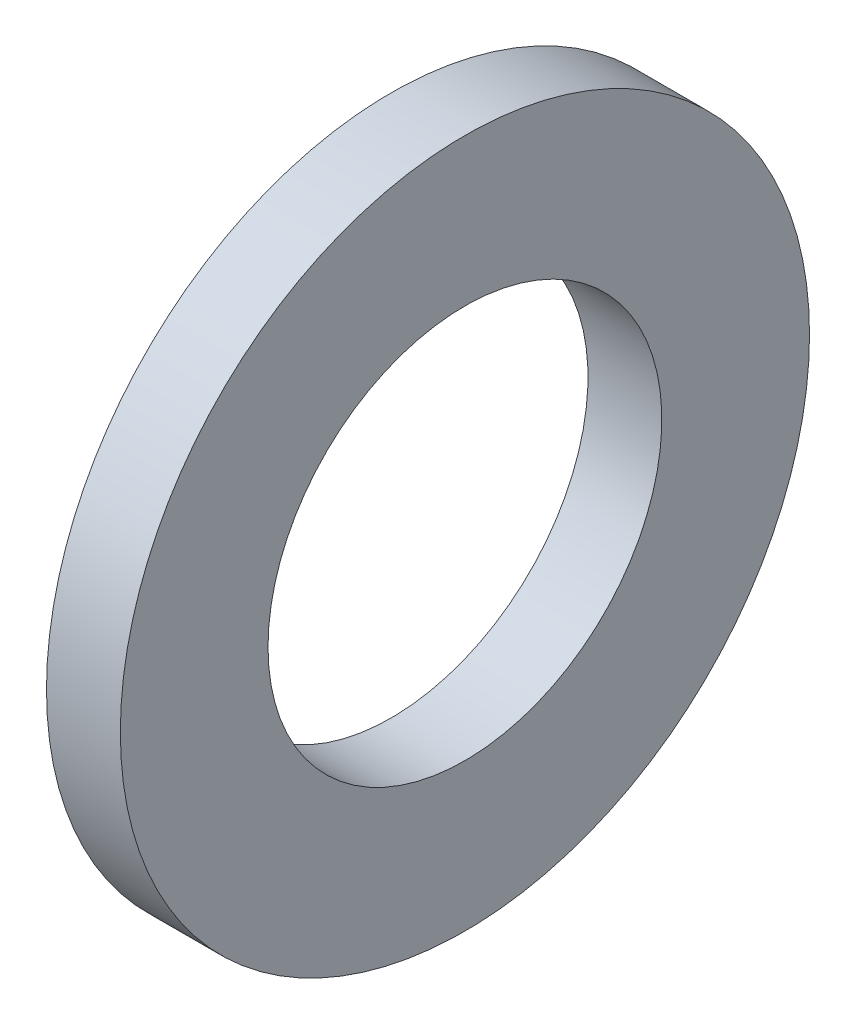
ISO-10303-21;
HEADER;
FILE_DESCRIPTION(('STEP AP214'),'2;1');
FILE_NAME('part.step','',(''),(''),'','','');
FILE_SCHEMA(('AUTOMOTIVE_DESIGN { 1 0 10303 214 1 1 1 1 }'));
ENDSEC;
DATA;
#1=APPLICATION_CONTEXT('core data for automotive mechanical design processes');
#2=APPLICATION_PROTOCOL_DEFINITION('international standard','automotive_design',2000,#1);
#3=PRODUCT_CONTEXT('',#1,'mechanical');
#4=PRODUCT('Part','Part','',(#3));
#5=PRODUCT_RELATED_PRODUCT_CATEGORY('part','',(#4));
#6=PRODUCT_DEFINITION_FORMATION('','',#4);
#7=PRODUCT_DEFINITION_CONTEXT('part definition',#1,'design');
#8=PRODUCT_DEFINITION('design','',#6,#7);
#9=PRODUCT_DEFINITION_SHAPE('','',#8);
#10=(LENGTH_UNIT() NAMED_UNIT(*) SI_UNIT(.MILLI.,.METRE.));
#11=(NAMED_UNIT(*) PLANE_ANGLE_UNIT() SI_UNIT($,.RADIAN.));
#12=(NAMED_UNIT(*) SI_UNIT($,.STERADIAN.) SOLID_ANGLE_UNIT());
#13=UNCERTAINTY_MEASURE_WITH_UNIT(LENGTH_MEASURE(1.E-05),#10,'distance_accuracy_value','');
#14=(GEOMETRIC_REPRESENTATION_CONTEXT(3) GLOBAL_UNCERTAINTY_ASSIGNED_CONTEXT((#13)) GLOBAL_UNIT_ASSIGNED_CONTEXT((#10,
#11,#12)) REPRESENTATION_CONTEXT('',''));
#15=CARTESIAN_POINT('',(0.,0.,0.));
#16=DIRECTION('',(0.,0.,1.));
#17=DIRECTION('',(1.,0.,0.));
#18=AXIS2_PLACEMENT_3D('',#15,#16,#17);
#19=CARTESIAN_POINT('',(-8.11298828999121,31.8954278680928,0.));
#20=DIRECTION('',(1.,0.,0.));
#21=DIRECTION('',(0.,0.,-1.));
#22=AXIS2_PLACEMENT_3D('',#19,#20,#21);
#23=PLANE('',#22);
#24=CARTESIAN_POINT('',(-8.11298828999121,27.8954278680927,0.));
#25=DIRECTION('',(-1.,0.,0.));
#26=DIRECTION('',(0.,0.,1.));
#27=AXIS2_PLACEMENT_3D('',#24,#25,#26);
#28=CIRCLE('',#27,4.);
#29=CARTESIAN_POINT('',(-8.11298828999121,27.8954278680927,4.));
#30=VERTEX_POINT('',#29);
#31=EDGE_CURVE('E45',#30,#30,#28,.T.);
#32=ORIENTED_EDGE('',*,*,#31,.F.);
#33=EDGE_LOOP('',(#32));
#34=FACE_BOUND('',#33,.T.);
#35=CARTESIAN_POINT('',(-8.11298828999121,27.8954278680927,0.));
#36=DIRECTION('',(-1.,0.,0.));
#37=DIRECTION('',(0.,0.,1.));
#38=AXIS2_PLACEMENT_3D('',#35,#36,#37);
#39=CIRCLE('',#38,7.);
#40=CARTESIAN_POINT('',(-8.11298828999121,27.8954278680927,7.));
#41=VERTEX_POINT('',#40);
#42=EDGE_CURVE('E10',#41,#41,#39,.T.);
#43=ORIENTED_EDGE('',*,*,#42,.T.);
#44=EDGE_LOOP('',(#43));
#45=FACE_BOUND('',#44,.T.);
#46=ADVANCED_FACE('F31',(#34,#45),#23,.F.);
#47=CARTESIAN_POINT('',(-46.9740585774058,27.8954278680927,0.));
#48=DIRECTION('',(-1.,0.,0.));
#49=DIRECTION('',(0.,0.,1.));
#50=AXIS2_PLACEMENT_3D('',#47,#48,#49);
#51=CYLINDRICAL_SURFACE('',#50,7.);
#52=ORIENTED_EDGE('',*,*,#42,.F.);
#53=EDGE_LOOP('',(#52));
#54=FACE_BOUND('',#53,.T.);
#55=CARTESIAN_POINT('',(-6.61298828999121,27.8954278680927,0.));
#56=DIRECTION('',(-1.,0.,0.));
#57=DIRECTION('',(0.,0.,1.));
#58=AXIS2_PLACEMENT_3D('',#55,#56,#57);
#59=CIRCLE('',#58,7.);
#60=CARTESIAN_POINT('',(-6.61298828999121,27.8954278680927,7.));
#61=VERTEX_POINT('',#60);
#62=EDGE_CURVE('E37',#61,#61,#59,.T.);
#63=ORIENTED_EDGE('',*,*,#62,.T.);
#64=EDGE_LOOP('',(#63));
#65=FACE_BOUND('',#64,.T.);
#66=ADVANCED_FACE('F54',(#54,#65),#51,.T.);
#67=CARTESIAN_POINT('',(-6.61298828999121,34.8954278680928,0.));
#68=DIRECTION('',(-1.,0.,0.));
#69=DIRECTION('',(0.,0.,1.));
#70=AXIS2_PLACEMENT_3D('',#67,#68,#69);
#71=PLANE('',#70);
#72=ORIENTED_EDGE('',*,*,#62,.F.);
#73=EDGE_LOOP('',(#72));
#74=FACE_BOUND('',#73,.T.);
#75=CARTESIAN_POINT('',(-6.61298828999121,27.8954278680927,0.));
#76=DIRECTION('',(-1.,0.,0.));
#77=DIRECTION('',(0.,0.,1.));
#78=AXIS2_PLACEMENT_3D('',#75,#76,#77);
#79=CIRCLE('',#78,4.);
#80=CARTESIAN_POINT('',(-6.61298828999121,27.8954278680927,4.));
#81=VERTEX_POINT('',#80);
#82=EDGE_CURVE('E41',#81,#81,#79,.T.);
#83=ORIENTED_EDGE('',*,*,#82,.T.);
#84=EDGE_LOOP('',(#83));
#85=FACE_BOUND('',#84,.T.);
#86=ADVANCED_FACE('F58',(#74,#85),#71,.F.);
#87=CARTESIAN_POINT('',(-46.9740585774058,27.8954278680927,0.));
#88=DIRECTION('',(-1.,0.,0.));
#89=DIRECTION('',(0.,0.,1.));
#90=AXIS2_PLACEMENT_3D('',#87,#88,#89);
#91=CYLINDRICAL_SURFACE('',#90,4.);
#92=ORIENTED_EDGE('',*,*,#82,.F.);
#93=EDGE_LOOP('',(#92));
#94=FACE_BOUND('',#93,.T.);
#95=ORIENTED_EDGE('',*,*,#31,.T.);
#96=EDGE_LOOP('',(#95));
#97=FACE_BOUND('',#96,.T.);
#98=ADVANCED_FACE('F51',(#94,#97),#91,.F.);
#99=CLOSED_SHELL('',(#46,#66,#86,#98));
#100=MANIFOLD_SOLID_BREP('B2',#99);
#101=ADVANCED_BREP_SHAPE_REPRESENTATION('',(#18,#100),#14);
#102=SHAPE_DEFINITION_REPRESENTATION(#9,#101);
ENDSEC;
END-ISO-10303-21;
